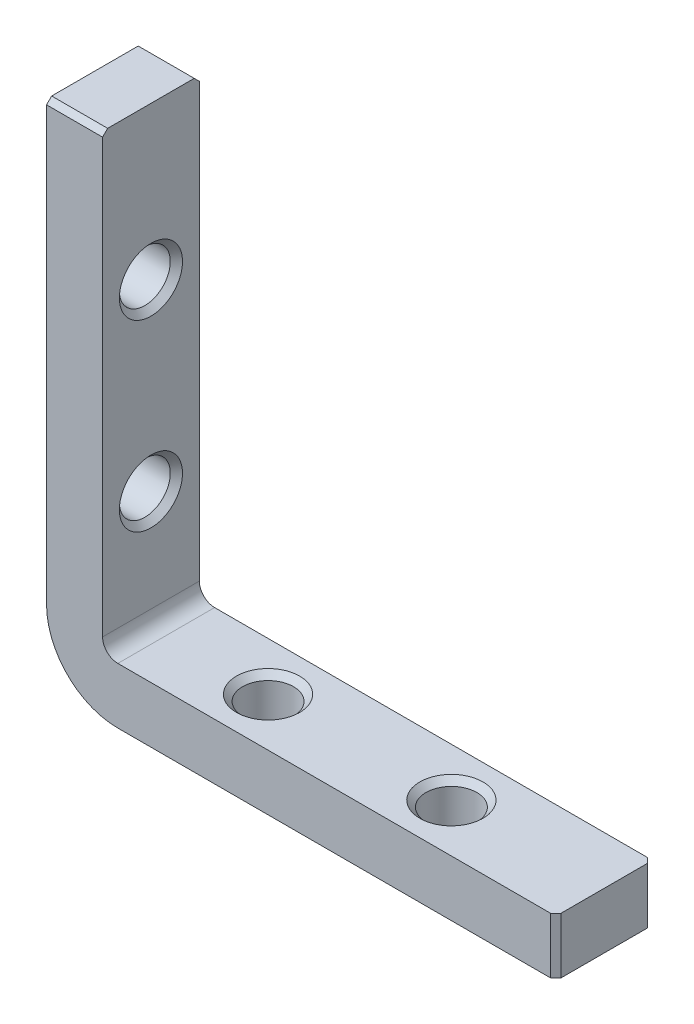
ISO-10303-21;
HEADER;
FILE_DESCRIPTION(('STEP AP214'),'2;1');
FILE_NAME('part.step','',(''),(''),'','','');
FILE_SCHEMA(('AUTOMOTIVE_DESIGN { 1 0 10303 214 1 1 1 1 }'));
ENDSEC;
DATA;
#1=APPLICATION_CONTEXT('core data for automotive mechanical design processes');
#2=APPLICATION_PROTOCOL_DEFINITION('international standard','automotive_design',2000,#1);
#3=PRODUCT_CONTEXT('',#1,'mechanical');
#4=PRODUCT('Part','Part','',(#3));
#5=PRODUCT_RELATED_PRODUCT_CATEGORY('part','',(#4));
#6=PRODUCT_DEFINITION_FORMATION('','',#4);
#7=PRODUCT_DEFINITION_CONTEXT('part definition',#1,'design');
#8=PRODUCT_DEFINITION('design','',#6,#7);
#9=PRODUCT_DEFINITION_SHAPE('','',#8);
#10=(LENGTH_UNIT() NAMED_UNIT(*) SI_UNIT(.MILLI.,.METRE.));
#11=(NAMED_UNIT(*) PLANE_ANGLE_UNIT() SI_UNIT($,.RADIAN.));
#12=(NAMED_UNIT(*) SI_UNIT($,.STERADIAN.) SOLID_ANGLE_UNIT());
#13=UNCERTAINTY_MEASURE_WITH_UNIT(LENGTH_MEASURE(1.E-05),#10,'distance_accuracy_value','');
#14=(GEOMETRIC_REPRESENTATION_CONTEXT(3) GLOBAL_UNCERTAINTY_ASSIGNED_CONTEXT((#13)) GLOBAL_UNIT_ASSIGNED_CONTEXT((#10,
#11,#12)) REPRESENTATION_CONTEXT('',''));
#15=CARTESIAN_POINT('',(0.,0.,0.));
#16=DIRECTION('',(0.,0.,1.));
#17=DIRECTION('',(1.,0.,0.));
#18=AXIS2_PLACEMENT_3D('',#15,#16,#17);
#19=CARTESIAN_POINT('',(5.50000000000001,50.,4.75));
#20=DIRECTION('',(0.,-1.,0.));
#21=DIRECTION('',(0.,0.,-1.));
#22=AXIS2_PLACEMENT_3D('',#19,#20,#21);
#23=PLANE('',#22);
#24=DIRECTION('',(0.,0.,-1.));
#25=VECTOR('',#24,1.);
#26=CARTESIAN_POINT('',(5.50000000000001,50.,4.75));
#27=LINE('',#26,#25);
#28=CARTESIAN_POINT('',(5.50000000000001,50.,4.25));
#29=VERTEX_POINT('',#28);
#30=CARTESIAN_POINT('',(5.50000000000001,50.,-4.25));
#31=VERTEX_POINT('',#30);
#32=EDGE_CURVE('E167',#29,#31,#27,.T.);
#33=ORIENTED_EDGE('',*,*,#32,.T.);
#34=DIRECTION('',(-1.,0.,0.));
#35=VECTOR('',#34,1.);
#36=CARTESIAN_POINT('',(5.50000000000001,50.,-4.25));
#37=LINE('',#36,#35);
#38=CARTESIAN_POINT('',(0.,50.,-4.25));
#39=VERTEX_POINT('',#38);
#40=EDGE_CURVE('E217',#31,#39,#37,.T.);
#41=ORIENTED_EDGE('',*,*,#40,.T.);
#42=DIRECTION('',(0.,0.,-1.));
#43=VECTOR('',#42,1.);
#44=CARTESIAN_POINT('',(0.,50.,4.75));
#45=LINE('',#44,#43);
#46=CARTESIAN_POINT('',(0.,50.,4.25));
#47=VERTEX_POINT('',#46);
#48=EDGE_CURVE('E150',#47,#39,#45,.T.);
#49=ORIENTED_EDGE('',*,*,#48,.F.);
#50=DIRECTION('',(1.,0.,0.));
#51=VECTOR('',#50,1.);
#52=CARTESIAN_POINT('',(5.50000000000001,50.,4.25));
#53=LINE('',#52,#51);
#54=EDGE_CURVE('E60',#47,#29,#53,.T.);
#55=ORIENTED_EDGE('',*,*,#54,.T.);
#56=EDGE_LOOP('',(#33,#41,#49,#55));
#57=FACE_BOUND('',#56,.T.);
#58=ADVANCED_FACE('F39',(#57),#23,.F.);
#59=CARTESIAN_POINT('',(0.,50.,4.75));
#60=DIRECTION('',(1.,0.,0.));
#61=DIRECTION('',(0.,0.,-1.));
#62=AXIS2_PLACEMENT_3D('',#59,#60,#61);
#63=PLANE('',#62);
#64=CARTESIAN_POINT('',(0.,35.,0.));
#65=DIRECTION('',(-1.,0.,0.));
#66=DIRECTION('',(0.,0.,1.));
#67=AXIS2_PLACEMENT_3D('',#64,#65,#66);
#68=CIRCLE('',#67,3.1);
#69=CARTESIAN_POINT('',(0.,35.,3.1));
#70=VERTEX_POINT('',#69);
#71=EDGE_CURVE('E529',#70,#70,#68,.T.);
#72=ORIENTED_EDGE('',*,*,#71,.F.);
#73=EDGE_LOOP('',(#72));
#74=FACE_BOUND('',#73,.T.);
#75=CARTESIAN_POINT('',(0.,17.,0.));
#76=DIRECTION('',(-1.,0.,0.));
#77=DIRECTION('',(0.,0.,1.));
#78=AXIS2_PLACEMENT_3D('',#75,#76,#77);
#79=CIRCLE('',#78,3.1);
#80=CARTESIAN_POINT('',(0.,17.,3.1));
#81=VERTEX_POINT('',#80);
#82=EDGE_CURVE('E517',#81,#81,#79,.T.);
#83=ORIENTED_EDGE('',*,*,#82,.F.);
#84=EDGE_LOOP('',(#83));
#85=FACE_BOUND('',#84,.T.);
#86=ORIENTED_EDGE('',*,*,#48,.T.);
#87=DIRECTION('',(0.,0.707106781186548,0.707106781186548));
#88=VECTOR('',#87,1.);
#89=CARTESIAN_POINT('',(0.,50.,-4.25));
#90=LINE('',#89,#88);
#91=CARTESIAN_POINT('',(0.,49.5,-4.75));
#92=VERTEX_POINT('',#91);
#93=EDGE_CURVE('E222',#39,#92,#90,.F.);
#94=ORIENTED_EDGE('',*,*,#93,.T.);
#95=DIRECTION('',(0.,-1.,0.));
#96=VECTOR('',#95,1.);
#97=CARTESIAN_POINT('',(0.,50.,-4.75));
#98=LINE('',#97,#96);
#99=CARTESIAN_POINT('',(0.,7.00000000000005,-4.75));
#100=VERTEX_POINT('',#99);
#101=EDGE_CURVE('E147',#92,#100,#98,.T.);
#102=ORIENTED_EDGE('',*,*,#101,.T.);
#103=DIRECTION('',(0.,0.,-1.));
#104=VECTOR('',#103,1.);
#105=CARTESIAN_POINT('',(0.,7.00000000000005,4.75));
#106=LINE('',#105,#104);
#107=CARTESIAN_POINT('',(0.,7.00000000000005,4.75));
#108=VERTEX_POINT('',#107);
#109=EDGE_CURVE('E143',#108,#100,#106,.T.);
#110=ORIENTED_EDGE('',*,*,#109,.F.);
#111=DIRECTION('',(0.,-1.,0.));
#112=VECTOR('',#111,1.);
#113=CARTESIAN_POINT('',(0.,50.,4.75));
#114=LINE('',#113,#112);
#115=CARTESIAN_POINT('',(0.,49.5,4.75));
#116=VERTEX_POINT('',#115);
#117=EDGE_CURVE('E129',#116,#108,#114,.T.);
#118=ORIENTED_EDGE('',*,*,#117,.F.);
#119=DIRECTION('',(0.,0.707106781186548,-0.707106781186548));
#120=VECTOR('',#119,1.);
#121=CARTESIAN_POINT('',(0.,49.5,4.75));
#122=LINE('',#121,#120);
#123=EDGE_CURVE('E220',#116,#47,#122,.T.);
#124=ORIENTED_EDGE('',*,*,#123,.T.);
#125=EDGE_LOOP('',(#86,#94,#102,#110,#118,#124));
#126=FACE_BOUND('',#125,.T.);
#127=ADVANCED_FACE('F145',(#74,#85,#126),#63,.F.);
#128=CARTESIAN_POINT('',(7.,7.,4.75));
#129=DIRECTION('',(0.,0.,-1.));
#130=DIRECTION('',(-1.,0.,0.));
#131=AXIS2_PLACEMENT_3D('',#128,#129,#130);
#132=CYLINDRICAL_SURFACE('',#131,7.);
#133=CARTESIAN_POINT('',(7.,7.,-4.75));
#134=DIRECTION('',(0.,0.,1.));
#135=DIRECTION('',(1.,0.,0.));
#136=AXIS2_PLACEMENT_3D('',#133,#134,#135);
#137=CIRCLE('',#136,7.);
#138=CARTESIAN_POINT('',(7.00000000000005,0.,-4.75));
#139=VERTEX_POINT('',#138);
#140=EDGE_CURVE('E169',#100,#139,#137,.T.);
#141=ORIENTED_EDGE('',*,*,#140,.T.);
#142=DIRECTION('',(0.,0.,-1.));
#143=VECTOR('',#142,1.);
#144=CARTESIAN_POINT('',(7.00000000000005,0.,4.75));
#145=LINE('',#144,#143);
#146=CARTESIAN_POINT('',(7.00000000000005,0.,4.75));
#147=VERTEX_POINT('',#146);
#148=EDGE_CURVE('E151',#147,#139,#145,.T.);
#149=ORIENTED_EDGE('',*,*,#148,.F.);
#150=CARTESIAN_POINT('',(7.,7.,4.75));
#151=DIRECTION('',(0.,0.,1.));
#152=DIRECTION('',(1.,0.,0.));
#153=AXIS2_PLACEMENT_3D('',#150,#151,#152);
#154=CIRCLE('',#153,7.);
#155=EDGE_CURVE('E134',#108,#147,#154,.T.);
#156=ORIENTED_EDGE('',*,*,#155,.F.);
#157=ORIENTED_EDGE('',*,*,#109,.T.);
#158=EDGE_LOOP('',(#141,#149,#156,#157));
#159=FACE_BOUND('',#158,.T.);
#160=ADVANCED_FACE('F153',(#159),#132,.T.);
#161=CARTESIAN_POINT('',(7.00000000000005,0.,4.75));
#162=DIRECTION('',(0.,1.,0.));
#163=DIRECTION('',(0.,0.,1.));
#164=AXIS2_PLACEMENT_3D('',#161,#162,#163);
#165=PLANE('',#164);
#166=CARTESIAN_POINT('',(35.,0.,0.));
#167=DIRECTION('',(0.,-1.,0.));
#168=DIRECTION('',(0.,0.,-1.));
#169=AXIS2_PLACEMENT_3D('',#166,#167,#168);
#170=CIRCLE('',#169,3.1);
#171=CARTESIAN_POINT('',(35.,0.,-3.1));
#172=VERTEX_POINT('',#171);
#173=EDGE_CURVE('E553',#172,#172,#170,.T.);
#174=ORIENTED_EDGE('',*,*,#173,.F.);
#175=EDGE_LOOP('',(#174));
#176=FACE_BOUND('',#175,.T.);
#177=CARTESIAN_POINT('',(17.,0.,0.));
#178=DIRECTION('',(0.,-1.,0.));
#179=DIRECTION('',(0.,0.,-1.));
#180=AXIS2_PLACEMENT_3D('',#177,#178,#179);
#181=CIRCLE('',#180,3.1);
#182=CARTESIAN_POINT('',(17.,0.,-3.1));
#183=VERTEX_POINT('',#182);
#184=EDGE_CURVE('E541',#183,#183,#181,.T.);
#185=ORIENTED_EDGE('',*,*,#184,.F.);
#186=EDGE_LOOP('',(#185));
#187=FACE_BOUND('',#186,.T.);
#188=DIRECTION('',(1.,0.,0.));
#189=VECTOR('',#188,1.);
#190=CARTESIAN_POINT('',(7.00000000000005,0.,-4.75));
#191=LINE('',#190,#189);
#192=CARTESIAN_POINT('',(49.5,0.,-4.75));
#193=VERTEX_POINT('',#192);
#194=EDGE_CURVE('E172',#139,#193,#191,.T.);
#195=ORIENTED_EDGE('',*,*,#194,.T.);
#196=DIRECTION('',(-0.707106781186548,0.,-0.707106781186548));
#197=VECTOR('',#196,1.);
#198=CARTESIAN_POINT('',(50.,0.,-4.25));
#199=LINE('',#198,#197);
#200=CARTESIAN_POINT('',(50.,0.,-4.25));
#201=VERTEX_POINT('',#200);
#202=EDGE_CURVE('E210',#193,#201,#199,.F.);
#203=ORIENTED_EDGE('',*,*,#202,.T.);
#204=DIRECTION('',(0.,0.,-1.));
#205=VECTOR('',#204,1.);
#206=CARTESIAN_POINT('',(50.,0.,4.75));
#207=LINE('',#206,#205);
#208=CARTESIAN_POINT('',(50.,0.,4.25));
#209=VERTEX_POINT('',#208);
#210=EDGE_CURVE('E190',#209,#201,#207,.T.);
#211=ORIENTED_EDGE('',*,*,#210,.F.);
#212=DIRECTION('',(-0.707106781186548,0.,0.707106781186548));
#213=VECTOR('',#212,1.);
#214=CARTESIAN_POINT('',(49.5,0.,4.75));
#215=LINE('',#214,#213);
#216=CARTESIAN_POINT('',(49.5,0.,4.75));
#217=VERTEX_POINT('',#216);
#218=EDGE_CURVE('E208',#209,#217,#215,.T.);
#219=ORIENTED_EDGE('',*,*,#218,.T.);
#220=DIRECTION('',(1.,0.,0.));
#221=VECTOR('',#220,1.);
#222=CARTESIAN_POINT('',(7.00000000000005,0.,4.75));
#223=LINE('',#222,#221);
#224=EDGE_CURVE('E156',#147,#217,#223,.T.);
#225=ORIENTED_EDGE('',*,*,#224,.F.);
#226=ORIENTED_EDGE('',*,*,#148,.T.);
#227=EDGE_LOOP('',(#195,#203,#211,#219,#225,#226));
#228=FACE_BOUND('',#227,.T.);
#229=ADVANCED_FACE('F239',(#176,#187,#228),#165,.F.);
#230=CARTESIAN_POINT('',(50.,5.50000000000001,4.75));
#231=DIRECTION('',(-1.,0.,0.));
#232=DIRECTION('',(0.,0.,1.));
#233=AXIS2_PLACEMENT_3D('',#230,#231,#232);
#234=PLANE('',#233);
#235=ORIENTED_EDGE('',*,*,#210,.T.);
#236=DIRECTION('',(0.,1.,0.));
#237=VECTOR('',#236,1.);
#238=CARTESIAN_POINT('',(50.,5.50000000000001,-4.25));
#239=LINE('',#238,#237);
#240=CARTESIAN_POINT('',(50.,5.50000000000001,-4.25));
#241=VERTEX_POINT('',#240);
#242=EDGE_CURVE('E197',#201,#241,#239,.T.);
#243=ORIENTED_EDGE('',*,*,#242,.T.);
#244=DIRECTION('',(0.,0.,-1.));
#245=VECTOR('',#244,1.);
#246=CARTESIAN_POINT('',(50.,5.50000000000001,4.75));
#247=LINE('',#246,#245);
#248=CARTESIAN_POINT('',(50.,5.50000000000001,4.25));
#249=VERTEX_POINT('',#248);
#250=EDGE_CURVE('E187',#249,#241,#247,.T.);
#251=ORIENTED_EDGE('',*,*,#250,.F.);
#252=DIRECTION('',(0.,-1.,0.));
#253=VECTOR('',#252,1.);
#254=CARTESIAN_POINT('',(50.,0.,4.25));
#255=LINE('',#254,#253);
#256=EDGE_CURVE('E195',#249,#209,#255,.T.);
#257=ORIENTED_EDGE('',*,*,#256,.T.);
#258=EDGE_LOOP('',(#235,#243,#251,#257));
#259=FACE_BOUND('',#258,.T.);
#260=ADVANCED_FACE('F253',(#259),#234,.F.);
#261=CARTESIAN_POINT('',(50.,5.50000000000001,4.75));
#262=DIRECTION('',(0.,-1.,0.));
#263=DIRECTION('',(1.,0.,0.));
#264=AXIS2_PLACEMENT_3D('',#261,#262,#263);
#265=PLANE('',#264);
#266=CARTESIAN_POINT('',(35.,5.49999999999999,0.));
#267=DIRECTION('',(0.,-1.,0.));
#268=DIRECTION('',(0.,0.,-1.));
#269=AXIS2_PLACEMENT_3D('',#266,#267,#268);
#270=CIRCLE('',#269,3.1);
#271=CARTESIAN_POINT('',(35.,5.49999999999999,-3.1));
#272=VERTEX_POINT('',#271);
#273=EDGE_CURVE('E556',#272,#272,#270,.T.);
#274=ORIENTED_EDGE('',*,*,#273,.T.);
#275=EDGE_LOOP('',(#274));
#276=FACE_BOUND('',#275,.T.);
#277=CARTESIAN_POINT('',(17.,5.49999999999999,0.));
#278=DIRECTION('',(0.,-1.,0.));
#279=DIRECTION('',(0.,0.,-1.));
#280=AXIS2_PLACEMENT_3D('',#277,#278,#279);
#281=CIRCLE('',#280,3.1);
#282=CARTESIAN_POINT('',(17.,5.49999999999999,-3.1));
#283=VERTEX_POINT('',#282);
#284=EDGE_CURVE('E544',#283,#283,#281,.T.);
#285=ORIENTED_EDGE('',*,*,#284,.T.);
#286=EDGE_LOOP('',(#285));
#287=FACE_BOUND('',#286,.T.);
#288=ORIENTED_EDGE('',*,*,#250,.T.);
#289=DIRECTION('',(0.707106781186548,0.,0.707106781186548));
#290=VECTOR('',#289,1.);
#291=CARTESIAN_POINT('',(50.,5.50000000000001,-4.25));
#292=LINE('',#291,#290);
#293=CARTESIAN_POINT('',(49.5,5.50000000000001,-4.75));
#294=VERTEX_POINT('',#293);
#295=EDGE_CURVE('E202',#241,#294,#292,.F.);
#296=ORIENTED_EDGE('',*,*,#295,.T.);
#297=DIRECTION('',(-1.,0.,0.));
#298=VECTOR('',#297,1.);
#299=CARTESIAN_POINT('',(50.,5.50000000000001,-4.75));
#300=LINE('',#299,#298);
#301=CARTESIAN_POINT('',(7.00000000000002,5.5,-4.75));
#302=VERTEX_POINT('',#301);
#303=EDGE_CURVE('E175',#294,#302,#300,.T.);
#304=ORIENTED_EDGE('',*,*,#303,.T.);
#305=DIRECTION('',(0.,0.,-1.));
#306=VECTOR('',#305,1.);
#307=CARTESIAN_POINT('',(7.00000000000002,5.5,4.75));
#308=LINE('',#307,#306);
#309=CARTESIAN_POINT('',(7.00000000000002,5.5,4.75));
#310=VERTEX_POINT('',#309);
#311=EDGE_CURVE('E184',#310,#302,#308,.T.);
#312=ORIENTED_EDGE('',*,*,#311,.F.);
#313=DIRECTION('',(-1.,0.,0.));
#314=VECTOR('',#313,1.);
#315=CARTESIAN_POINT('',(50.,5.50000000000001,4.75));
#316=LINE('',#315,#314);
#317=CARTESIAN_POINT('',(49.5,5.50000000000001,4.75));
#318=VERTEX_POINT('',#317);
#319=EDGE_CURVE('E158',#318,#310,#316,.T.);
#320=ORIENTED_EDGE('',*,*,#319,.F.);
#321=DIRECTION('',(0.707106781186548,0.,-0.707106781186548));
#322=VECTOR('',#321,1.);
#323=CARTESIAN_POINT('',(49.5,5.50000000000001,4.75));
#324=LINE('',#323,#322);
#325=EDGE_CURVE('E200',#318,#249,#324,.T.);
#326=ORIENTED_EDGE('',*,*,#325,.T.);
#327=EDGE_LOOP('',(#288,#296,#304,#312,#320,#326));
#328=FACE_BOUND('',#327,.T.);
#329=ADVANCED_FACE('F250',(#276,#287,#328),#265,.F.);
#330=CARTESIAN_POINT('',(7.,7.,4.75));
#331=DIRECTION('',(0.,0.,-1.));
#332=DIRECTION('',(-1.,0.,0.));
#333=AXIS2_PLACEMENT_3D('',#330,#331,#332);
#334=CYLINDRICAL_SURFACE('',#333,1.5);
#335=CARTESIAN_POINT('',(7.,7.,-4.75));
#336=DIRECTION('',(0.,0.,-1.));
#337=DIRECTION('',(-1.,0.,0.));
#338=AXIS2_PLACEMENT_3D('',#335,#336,#337);
#339=CIRCLE('',#338,1.5);
#340=CARTESIAN_POINT('',(5.50000000000001,7.,-4.75));
#341=VERTEX_POINT('',#340);
#342=EDGE_CURVE('E177',#302,#341,#339,.T.);
#343=ORIENTED_EDGE('',*,*,#342,.T.);
#344=DIRECTION('',(0.,0.,-1.));
#345=VECTOR('',#344,1.);
#346=CARTESIAN_POINT('',(5.50000000000001,7.,4.75));
#347=LINE('',#346,#345);
#348=CARTESIAN_POINT('',(5.50000000000001,7.,4.75));
#349=VERTEX_POINT('',#348);
#350=EDGE_CURVE('E181',#349,#341,#347,.T.);
#351=ORIENTED_EDGE('',*,*,#350,.F.);
#352=CARTESIAN_POINT('',(7.,7.,4.75));
#353=DIRECTION('',(0.,0.,-1.));
#354=DIRECTION('',(-1.,0.,0.));
#355=AXIS2_PLACEMENT_3D('',#352,#353,#354);
#356=CIRCLE('',#355,1.5);
#357=EDGE_CURVE('E163',#310,#349,#356,.T.);
#358=ORIENTED_EDGE('',*,*,#357,.F.);
#359=ORIENTED_EDGE('',*,*,#311,.T.);
#360=EDGE_LOOP('',(#343,#351,#358,#359));
#361=FACE_BOUND('',#360,.T.);
#362=ADVANCED_FACE('F260',(#361),#334,.F.);
#363=CARTESIAN_POINT('',(5.50000000000001,7.00000000000001,4.75));
#364=DIRECTION('',(-1.,0.,0.));
#365=DIRECTION('',(0.,0.,1.));
#366=AXIS2_PLACEMENT_3D('',#363,#364,#365);
#367=PLANE('',#366);
#368=CARTESIAN_POINT('',(5.5,35.,0.));
#369=DIRECTION('',(-1.,0.,0.));
#370=DIRECTION('',(0.,0.,1.));
#371=AXIS2_PLACEMENT_3D('',#368,#369,#370);
#372=CIRCLE('',#371,3.1);
#373=CARTESIAN_POINT('',(5.5,35.,3.1));
#374=VERTEX_POINT('',#373);
#375=EDGE_CURVE('E532',#374,#374,#372,.T.);
#376=ORIENTED_EDGE('',*,*,#375,.T.);
#377=EDGE_LOOP('',(#376));
#378=FACE_BOUND('',#377,.T.);
#379=CARTESIAN_POINT('',(5.5,17.,0.));
#380=DIRECTION('',(-1.,0.,0.));
#381=DIRECTION('',(0.,0.,1.));
#382=AXIS2_PLACEMENT_3D('',#379,#380,#381);
#383=CIRCLE('',#382,3.1);
#384=CARTESIAN_POINT('',(5.5,17.,3.1));
#385=VERTEX_POINT('',#384);
#386=EDGE_CURVE('E512',#385,#385,#383,.T.);
#387=ORIENTED_EDGE('',*,*,#386,.T.);
#388=EDGE_LOOP('',(#387));
#389=FACE_BOUND('',#388,.T.);
#390=DIRECTION('',(0.,1.,0.));
#391=VECTOR('',#390,1.);
#392=CARTESIAN_POINT('',(5.50000000000001,7.00000000000001,-4.75));
#393=LINE('',#392,#391);
#394=CARTESIAN_POINT('',(5.50000000000001,49.5,-4.75));
#395=VERTEX_POINT('',#394);
#396=EDGE_CURVE('E140',#341,#395,#393,.T.);
#397=ORIENTED_EDGE('',*,*,#396,.T.);
#398=DIRECTION('',(0.,-0.707106781186548,-0.707106781186548));
#399=VECTOR('',#398,1.);
#400=CARTESIAN_POINT('',(5.50000000000001,50.,-4.25));
#401=LINE('',#400,#399);
#402=EDGE_CURVE('E11',#395,#31,#401,.F.);
#403=ORIENTED_EDGE('',*,*,#402,.T.);
#404=ORIENTED_EDGE('',*,*,#32,.F.);
#405=DIRECTION('',(0.,-0.707106781186548,0.707106781186548));
#406=VECTOR('',#405,1.);
#407=CARTESIAN_POINT('',(5.50000000000001,49.5,4.75));
#408=LINE('',#407,#406);
#409=CARTESIAN_POINT('',(5.50000000000001,49.5,4.75));
#410=VERTEX_POINT('',#409);
#411=EDGE_CURVE('E48',#29,#410,#408,.T.);
#412=ORIENTED_EDGE('',*,*,#411,.T.);
#413=DIRECTION('',(0.,1.,0.));
#414=VECTOR('',#413,1.);
#415=CARTESIAN_POINT('',(5.50000000000001,7.00000000000001,4.75));
#416=LINE('',#415,#414);
#417=EDGE_CURVE('E165',#349,#410,#416,.T.);
#418=ORIENTED_EDGE('',*,*,#417,.F.);
#419=ORIENTED_EDGE('',*,*,#350,.T.);
#420=EDGE_LOOP('',(#397,#403,#404,#412,#418,#419));
#421=FACE_BOUND('',#420,.T.);
#422=ADVANCED_FACE('F225',(#378,#389,#421),#367,.F.);
#423=CARTESIAN_POINT('',(7.,7.,4.75));
#424=DIRECTION('',(0.,0.,1.));
#425=DIRECTION('',(1.,0.,0.));
#426=AXIS2_PLACEMENT_3D('',#423,#424,#425);
#427=PLANE('',#426);
#428=ORIENTED_EDGE('',*,*,#224,.T.);
#429=DIRECTION('',(0.,1.,0.));
#430=VECTOR('',#429,1.);
#431=CARTESIAN_POINT('',(49.5,5.50000000000001,4.75));
#432=LINE('',#431,#430);
#433=EDGE_CURVE('E213',#217,#318,#432,.T.);
#434=ORIENTED_EDGE('',*,*,#433,.T.);
#435=ORIENTED_EDGE('',*,*,#319,.T.);
#436=ORIENTED_EDGE('',*,*,#357,.T.);
#437=ORIENTED_EDGE('',*,*,#417,.T.);
#438=DIRECTION('',(-1.,0.,0.));
#439=VECTOR('',#438,1.);
#440=CARTESIAN_POINT('',(0.,49.5,4.75));
#441=LINE('',#440,#439);
#442=EDGE_CURVE('E138',#410,#116,#441,.T.);
#443=ORIENTED_EDGE('',*,*,#442,.T.);
#444=ORIENTED_EDGE('',*,*,#117,.T.);
#445=ORIENTED_EDGE('',*,*,#155,.T.);
#446=EDGE_LOOP('',(#428,#434,#435,#436,#437,#443,#444,#445));
#447=FACE_BOUND('',#446,.T.);
#448=ADVANCED_FACE('F132',(#447),#427,.T.);
#449=CARTESIAN_POINT('',(7.,7.,-4.75));
#450=DIRECTION('',(0.,0.,1.));
#451=DIRECTION('',(1.,0.,0.));
#452=AXIS2_PLACEMENT_3D('',#449,#450,#451);
#453=PLANE('',#452);
#454=ORIENTED_EDGE('',*,*,#303,.F.);
#455=DIRECTION('',(0.,-1.,0.));
#456=VECTOR('',#455,1.);
#457=CARTESIAN_POINT('',(49.5,7.,-4.75));
#458=LINE('',#457,#456);
#459=EDGE_CURVE('E206',#294,#193,#458,.T.);
#460=ORIENTED_EDGE('',*,*,#459,.T.);
#461=ORIENTED_EDGE('',*,*,#194,.F.);
#462=ORIENTED_EDGE('',*,*,#140,.F.);
#463=ORIENTED_EDGE('',*,*,#101,.F.);
#464=DIRECTION('',(1.,0.,0.));
#465=VECTOR('',#464,1.);
#466=CARTESIAN_POINT('',(7.,49.5,-4.75));
#467=LINE('',#466,#465);
#468=EDGE_CURVE('E204',#92,#395,#467,.T.);
#469=ORIENTED_EDGE('',*,*,#468,.T.);
#470=ORIENTED_EDGE('',*,*,#396,.F.);
#471=ORIENTED_EDGE('',*,*,#342,.F.);
#472=EDGE_LOOP('',(#454,#460,#461,#462,#463,#469,#470,#471));
#473=FACE_BOUND('',#472,.T.);
#474=ADVANCED_FACE('F235',(#473),#453,.F.);
#475=CARTESIAN_POINT('',(4.9,17.,0.));
#476=DIRECTION('',(1.,0.,0.));
#477=DIRECTION('',(0.,0.,-1.));
#478=AXIS2_PLACEMENT_3D('',#475,#476,#477);
#479=CONICAL_SURFACE('',#478,2.5,0.785398163397445);
#480=ORIENTED_EDGE('',*,*,#386,.F.);
#481=EDGE_LOOP('',(#480));
#482=FACE_BOUND('',#481,.T.);
#483=CARTESIAN_POINT('',(4.9,17.,0.));
#484=DIRECTION('',(-1.,0.,0.));
#485=DIRECTION('',(0.,0.,1.));
#486=AXIS2_PLACEMENT_3D('',#483,#484,#485);
#487=CIRCLE('',#486,2.5);
#488=CARTESIAN_POINT('',(4.9,17.,2.5));
#489=VERTEX_POINT('',#488);
#490=EDGE_CURVE('E170',#489,#489,#487,.T.);
#491=ORIENTED_EDGE('',*,*,#490,.T.);
#492=EDGE_LOOP('',(#491));
#493=FACE_BOUND('',#492,.T.);
#494=ADVANCED_FACE('F326',(#482,#493),#479,.F.);
#495=CARTESIAN_POINT('',(0.,17.,0.));
#496=DIRECTION('',(-1.,0.,0.));
#497=DIRECTION('',(0.,0.,1.));
#498=AXIS2_PLACEMENT_3D('',#495,#496,#497);
#499=CYLINDRICAL_SURFACE('',#498,2.5);
#500=ORIENTED_EDGE('',*,*,#490,.F.);
#501=EDGE_LOOP('',(#500));
#502=FACE_BOUND('',#501,.T.);
#503=CARTESIAN_POINT('',(0.6,17.,0.));
#504=DIRECTION('',(-1.,0.,0.));
#505=DIRECTION('',(0.,0.,1.));
#506=AXIS2_PLACEMENT_3D('',#503,#504,#505);
#507=CIRCLE('',#506,2.5);
#508=CARTESIAN_POINT('',(0.6,17.,2.5));
#509=VERTEX_POINT('',#508);
#510=EDGE_CURVE('E515',#509,#509,#507,.T.);
#511=ORIENTED_EDGE('',*,*,#510,.T.);
#512=EDGE_LOOP('',(#511));
#513=FACE_BOUND('',#512,.T.);
#514=ADVANCED_FACE('F479',(#502,#513),#499,.F.);
#515=CARTESIAN_POINT('',(0.,17.,0.));
#516=DIRECTION('',(-1.,0.,0.));
#517=DIRECTION('',(0.,0.,1.));
#518=AXIS2_PLACEMENT_3D('',#515,#516,#517);
#519=CONICAL_SURFACE('',#518,3.1,0.785398163397449);
#520=ORIENTED_EDGE('',*,*,#510,.F.);
#521=EDGE_LOOP('',(#520));
#522=FACE_BOUND('',#521,.T.);
#523=ORIENTED_EDGE('',*,*,#82,.T.);
#524=EDGE_LOOP('',(#523));
#525=FACE_BOUND('',#524,.T.);
#526=ADVANCED_FACE('F469',(#522,#525),#519,.F.);
#527=CARTESIAN_POINT('',(4.9,35.,0.));
#528=DIRECTION('',(1.,0.,0.));
#529=DIRECTION('',(0.,0.,-1.));
#530=AXIS2_PLACEMENT_3D('',#527,#528,#529);
#531=CONICAL_SURFACE('',#530,2.5,0.785398163397443);
#532=ORIENTED_EDGE('',*,*,#375,.F.);
#533=EDGE_LOOP('',(#532));
#534=FACE_BOUND('',#533,.T.);
#535=CARTESIAN_POINT('',(4.9,35.,0.));
#536=DIRECTION('',(-1.,0.,0.));
#537=DIRECTION('',(0.,0.,1.));
#538=AXIS2_PLACEMENT_3D('',#535,#536,#537);
#539=CIRCLE('',#538,2.5);
#540=CARTESIAN_POINT('',(4.9,35.,2.5));
#541=VERTEX_POINT('',#540);
#542=EDGE_CURVE('E523',#541,#541,#539,.T.);
#543=ORIENTED_EDGE('',*,*,#542,.T.);
#544=EDGE_LOOP('',(#543));
#545=FACE_BOUND('',#544,.T.);
#546=ADVANCED_FACE('F459',(#534,#545),#531,.F.);
#547=CARTESIAN_POINT('',(0.,35.,0.));
#548=DIRECTION('',(-1.,0.,0.));
#549=DIRECTION('',(0.,0.,1.));
#550=AXIS2_PLACEMENT_3D('',#547,#548,#549);
#551=CYLINDRICAL_SURFACE('',#550,2.5);
#552=ORIENTED_EDGE('',*,*,#542,.F.);
#553=EDGE_LOOP('',(#552));
#554=FACE_BOUND('',#553,.T.);
#555=CARTESIAN_POINT('',(0.6,35.,0.));
#556=DIRECTION('',(-1.,0.,0.));
#557=DIRECTION('',(0.,0.,1.));
#558=AXIS2_PLACEMENT_3D('',#555,#556,#557);
#559=CIRCLE('',#558,2.5);
#560=CARTESIAN_POINT('',(0.6,35.,2.5));
#561=VERTEX_POINT('',#560);
#562=EDGE_CURVE('E526',#561,#561,#559,.T.);
#563=ORIENTED_EDGE('',*,*,#562,.T.);
#564=EDGE_LOOP('',(#563));
#565=FACE_BOUND('',#564,.T.);
#566=ADVANCED_FACE('F448',(#554,#565),#551,.F.);
#567=CARTESIAN_POINT('',(0.,35.,0.));
#568=DIRECTION('',(-1.,0.,0.));
#569=DIRECTION('',(0.,0.,1.));
#570=AXIS2_PLACEMENT_3D('',#567,#568,#569);
#571=CONICAL_SURFACE('',#570,3.1,0.785398163397444);
#572=ORIENTED_EDGE('',*,*,#562,.F.);
#573=EDGE_LOOP('',(#572));
#574=FACE_BOUND('',#573,.T.);
#575=ORIENTED_EDGE('',*,*,#71,.T.);
#576=EDGE_LOOP('',(#575));
#577=FACE_BOUND('',#576,.T.);
#578=ADVANCED_FACE('F438',(#574,#577),#571,.F.);
#579=CARTESIAN_POINT('',(17.,4.89999999999999,0.));
#580=DIRECTION('',(0.,1.,0.));
#581=DIRECTION('',(0.,0.,1.));
#582=AXIS2_PLACEMENT_3D('',#579,#580,#581);
#583=CONICAL_SURFACE('',#582,2.5,0.785398163397445);
#584=ORIENTED_EDGE('',*,*,#284,.F.);
#585=EDGE_LOOP('',(#584));
#586=FACE_BOUND('',#585,.T.);
#587=CARTESIAN_POINT('',(17.,4.89999999999999,0.));
#588=DIRECTION('',(0.,-1.,0.));
#589=DIRECTION('',(0.,0.,-1.));
#590=AXIS2_PLACEMENT_3D('',#587,#588,#589);
#591=CIRCLE('',#590,2.5);
#592=CARTESIAN_POINT('',(17.,4.89999999999999,-2.5));
#593=VERTEX_POINT('',#592);
#594=EDGE_CURVE('E535',#593,#593,#591,.T.);
#595=ORIENTED_EDGE('',*,*,#594,.T.);
#596=EDGE_LOOP('',(#595));
#597=FACE_BOUND('',#596,.T.);
#598=ADVANCED_FACE('F428',(#586,#597),#583,.F.);
#599=CARTESIAN_POINT('',(17.,0.,0.));
#600=DIRECTION('',(0.,-1.,0.));
#601=DIRECTION('',(0.,0.,-1.));
#602=AXIS2_PLACEMENT_3D('',#599,#600,#601);
#603=CYLINDRICAL_SURFACE('',#602,2.5);
#604=ORIENTED_EDGE('',*,*,#594,.F.);
#605=EDGE_LOOP('',(#604));
#606=FACE_BOUND('',#605,.T.);
#607=CARTESIAN_POINT('',(17.,0.599999999999993,0.));
#608=DIRECTION('',(0.,-1.,0.));
#609=DIRECTION('',(0.,0.,-1.));
#610=AXIS2_PLACEMENT_3D('',#607,#608,#609);
#611=CIRCLE('',#610,2.5);
#612=CARTESIAN_POINT('',(17.,0.599999999999993,-2.5));
#613=VERTEX_POINT('',#612);
#614=EDGE_CURVE('E538',#613,#613,#611,.T.);
#615=ORIENTED_EDGE('',*,*,#614,.T.);
#616=EDGE_LOOP('',(#615));
#617=FACE_BOUND('',#616,.T.);
#618=ADVANCED_FACE('F418',(#606,#617),#603,.F.);
#619=CARTESIAN_POINT('',(17.,0.,0.));
#620=DIRECTION('',(0.,-1.,0.));
#621=DIRECTION('',(0.,0.,-1.));
#622=AXIS2_PLACEMENT_3D('',#619,#620,#621);
#623=CONICAL_SURFACE('',#622,3.1,0.785398163397449);
#624=ORIENTED_EDGE('',*,*,#614,.F.);
#625=EDGE_LOOP('',(#624));
#626=FACE_BOUND('',#625,.T.);
#627=ORIENTED_EDGE('',*,*,#184,.T.);
#628=EDGE_LOOP('',(#627));
#629=FACE_BOUND('',#628,.T.);
#630=ADVANCED_FACE('F408',(#626,#629),#623,.F.);
#631=CARTESIAN_POINT('',(35.,4.89999999999998,0.));
#632=DIRECTION('',(0.,1.,0.));
#633=DIRECTION('',(0.,0.,1.));
#634=AXIS2_PLACEMENT_3D('',#631,#632,#633);
#635=CONICAL_SURFACE('',#634,2.5,0.785398163397443);
#636=ORIENTED_EDGE('',*,*,#273,.F.);
#637=EDGE_LOOP('',(#636));
#638=FACE_BOUND('',#637,.T.);
#639=CARTESIAN_POINT('',(35.,4.89999999999998,0.));
#640=DIRECTION('',(0.,-1.,0.));
#641=DIRECTION('',(0.,0.,-1.));
#642=AXIS2_PLACEMENT_3D('',#639,#640,#641);
#643=CIRCLE('',#642,2.5);
#644=CARTESIAN_POINT('',(35.,4.89999999999998,-2.5));
#645=VERTEX_POINT('',#644);
#646=EDGE_CURVE('E547',#645,#645,#643,.T.);
#647=ORIENTED_EDGE('',*,*,#646,.T.);
#648=EDGE_LOOP('',(#647));
#649=FACE_BOUND('',#648,.T.);
#650=ADVANCED_FACE('F396',(#638,#649),#635,.F.);
#651=CARTESIAN_POINT('',(35.,0.,0.));
#652=DIRECTION('',(0.,-1.,0.));
#653=DIRECTION('',(0.,0.,-1.));
#654=AXIS2_PLACEMENT_3D('',#651,#652,#653);
#655=CYLINDRICAL_SURFACE('',#654,2.5);
#656=ORIENTED_EDGE('',*,*,#646,.F.);
#657=EDGE_LOOP('',(#656));
#658=FACE_BOUND('',#657,.T.);
#659=CARTESIAN_POINT('',(35.,0.599999999999985,0.));
#660=DIRECTION('',(0.,-1.,0.));
#661=DIRECTION('',(0.,0.,-1.));
#662=AXIS2_PLACEMENT_3D('',#659,#660,#661);
#663=CIRCLE('',#662,2.5);
#664=CARTESIAN_POINT('',(35.,0.599999999999985,-2.5));
#665=VERTEX_POINT('',#664);
#666=EDGE_CURVE('E550',#665,#665,#663,.T.);
#667=ORIENTED_EDGE('',*,*,#666,.T.);
#668=EDGE_LOOP('',(#667));
#669=FACE_BOUND('',#668,.T.);
#670=ADVANCED_FACE('F385',(#658,#669),#655,.F.);
#671=CARTESIAN_POINT('',(35.,0.,0.));
#672=DIRECTION('',(0.,-1.,0.));
#673=DIRECTION('',(0.,0.,-1.));
#674=AXIS2_PLACEMENT_3D('',#671,#672,#673);
#675=CONICAL_SURFACE('',#674,3.1,0.785398163397444);
#676=ORIENTED_EDGE('',*,*,#666,.F.);
#677=EDGE_LOOP('',(#676));
#678=FACE_BOUND('',#677,.T.);
#679=ORIENTED_EDGE('',*,*,#173,.T.);
#680=EDGE_LOOP('',(#679));
#681=FACE_BOUND('',#680,.T.);
#682=ADVANCED_FACE('F286',(#678,#681),#675,.F.);
#683=CARTESIAN_POINT('',(50.,5.50000000000001,-4.25));
#684=DIRECTION('',(-0.707106781186547,0.,0.707106781186547));
#685=DIRECTION('',(0.,1.,0.));
#686=AXIS2_PLACEMENT_3D('',#683,#684,#685);
#687=PLANE('',#686);
#688=ORIENTED_EDGE('',*,*,#202,.F.);
#689=ORIENTED_EDGE('',*,*,#459,.F.);
#690=ORIENTED_EDGE('',*,*,#295,.F.);
#691=ORIENTED_EDGE('',*,*,#242,.F.);
#692=EDGE_LOOP('',(#688,#689,#690,#691));
#693=FACE_BOUND('',#692,.T.);
#694=ADVANCED_FACE('F256',(#693),#687,.F.);
#695=CARTESIAN_POINT('',(49.5,7.,4.75));
#696=DIRECTION('',(0.707106781186547,0.,0.707106781186547));
#697=DIRECTION('',(0.,-1.,0.));
#698=AXIS2_PLACEMENT_3D('',#695,#696,#697);
#699=PLANE('',#698);
#700=ORIENTED_EDGE('',*,*,#218,.F.);
#701=ORIENTED_EDGE('',*,*,#256,.F.);
#702=ORIENTED_EDGE('',*,*,#325,.F.);
#703=ORIENTED_EDGE('',*,*,#433,.F.);
#704=EDGE_LOOP('',(#700,#701,#702,#703));
#705=FACE_BOUND('',#704,.T.);
#706=ADVANCED_FACE('F246',(#705),#699,.T.);
#707=CARTESIAN_POINT('',(5.50000000000001,50.,-4.25));
#708=DIRECTION('',(0.,-0.707106781186547,0.707106781186547));
#709=DIRECTION('',(-1.,0.,0.));
#710=AXIS2_PLACEMENT_3D('',#707,#708,#709);
#711=PLANE('',#710);
#712=ORIENTED_EDGE('',*,*,#402,.F.);
#713=ORIENTED_EDGE('',*,*,#468,.F.);
#714=ORIENTED_EDGE('',*,*,#93,.F.);
#715=ORIENTED_EDGE('',*,*,#40,.F.);
#716=EDGE_LOOP('',(#712,#713,#714,#715));
#717=FACE_BOUND('',#716,.T.);
#718=ADVANCED_FACE('F231',(#717),#711,.F.);
#719=CARTESIAN_POINT('',(7.,49.5,4.75));
#720=DIRECTION('',(0.,0.707106781186547,0.707106781186547));
#721=DIRECTION('',(1.,0.,0.));
#722=AXIS2_PLACEMENT_3D('',#719,#720,#721);
#723=PLANE('',#722);
#724=ORIENTED_EDGE('',*,*,#411,.F.);
#725=ORIENTED_EDGE('',*,*,#54,.F.);
#726=ORIENTED_EDGE('',*,*,#123,.F.);
#727=ORIENTED_EDGE('',*,*,#442,.F.);
#728=EDGE_LOOP('',(#724,#725,#726,#727));
#729=FACE_BOUND('',#728,.T.);
#730=ADVANCED_FACE('F42',(#729),#723,.T.);
#731=CLOSED_SHELL('',(#58,#127,#160,#229,#260,#329,#362,#422,#448,#474,#494,#514,#526,#546,#566,
#578,#598,#618,#630,#650,#670,#682,#694,#706,#718,#730));
#732=MANIFOLD_SOLID_BREP('B2',#731);
#733=ADVANCED_BREP_SHAPE_REPRESENTATION('',(#18,#732),#14);
#734=SHAPE_DEFINITION_REPRESENTATION(#9,#733);
ENDSEC;
END-ISO-10303-21;
